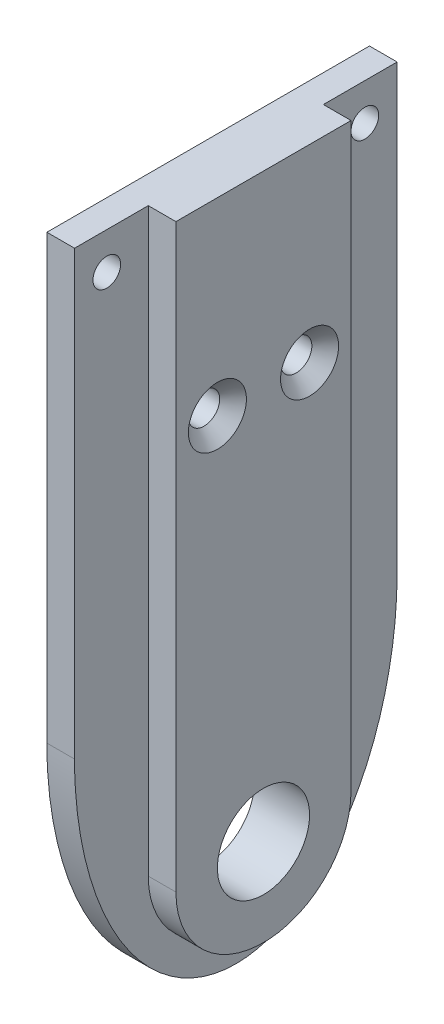
ISO-10303-21;
HEADER;
FILE_DESCRIPTION(('STEP AP214'),'2;1');
FILE_NAME('part.step','',(''),(''),'','','');
FILE_SCHEMA(('AUTOMOTIVE_DESIGN { 1 0 10303 214 1 1 1 1 }'));
ENDSEC;
DATA;
#1=APPLICATION_CONTEXT('core data for automotive mechanical design processes');
#2=APPLICATION_PROTOCOL_DEFINITION('international standard','automotive_design',2000,#1);
#3=PRODUCT_CONTEXT('',#1,'mechanical');
#4=PRODUCT('Part','Part','',(#3));
#5=PRODUCT_RELATED_PRODUCT_CATEGORY('part','',(#4));
#6=PRODUCT_DEFINITION_FORMATION('','',#4);
#7=PRODUCT_DEFINITION_CONTEXT('part definition',#1,'design');
#8=PRODUCT_DEFINITION('design','',#6,#7);
#9=PRODUCT_DEFINITION_SHAPE('','',#8);
#10=(LENGTH_UNIT() NAMED_UNIT(*) SI_UNIT(.MILLI.,.METRE.));
#11=(NAMED_UNIT(*) PLANE_ANGLE_UNIT() SI_UNIT($,.RADIAN.));
#12=(NAMED_UNIT(*) SI_UNIT($,.STERADIAN.) SOLID_ANGLE_UNIT());
#13=UNCERTAINTY_MEASURE_WITH_UNIT(LENGTH_MEASURE(1.E-05),#10,'distance_accuracy_value','');
#14=(GEOMETRIC_REPRESENTATION_CONTEXT(3) GLOBAL_UNCERTAINTY_ASSIGNED_CONTEXT((#13)) GLOBAL_UNIT_ASSIGNED_CONTEXT((#10,
#11,#12)) REPRESENTATION_CONTEXT('',''));
#15=CARTESIAN_POINT('',(0.,0.,0.));
#16=DIRECTION('',(0.,0.,1.));
#17=DIRECTION('',(1.,0.,0.));
#18=AXIS2_PLACEMENT_3D('',#15,#16,#17);
#19=CARTESIAN_POINT('',(6.,0.,-17.5));
#20=DIRECTION('',(0.,0.,1.));
#21=DIRECTION('',(1.,0.,0.));
#22=AXIS2_PLACEMENT_3D('',#19,#20,#21);
#23=PLANE('',#22);
#24=DIRECTION('',(1.,0.,0.));
#25=VECTOR('',#24,1.);
#26=CARTESIAN_POINT('',(-47.762432936357,15.,-17.5));
#27=LINE('',#26,#25);
#28=CARTESIAN_POINT('',(0.,15.,-17.5));
#29=VERTEX_POINT('',#28);
#30=CARTESIAN_POINT('',(3.,15.,-17.5));
#31=VERTEX_POINT('',#30);
#32=EDGE_CURVE('E53',#29,#31,#27,.T.);
#33=ORIENTED_EDGE('',*,*,#32,.F.);
#34=DIRECTION('',(0.,1.,0.));
#35=VECTOR('',#34,1.);
#36=CARTESIAN_POINT('',(0.,0.,-17.5));
#37=LINE('',#36,#35);
#38=CARTESIAN_POINT('',(0.,63.,-17.5));
#39=VERTEX_POINT('',#38);
#40=EDGE_CURVE('E153',#29,#39,#37,.T.);
#41=ORIENTED_EDGE('',*,*,#40,.T.);
#42=DIRECTION('',(-1.,0.,0.));
#43=VECTOR('',#42,1.);
#44=CARTESIAN_POINT('',(6.,63.,-17.5));
#45=LINE('',#44,#43);
#46=CARTESIAN_POINT('',(3.,63.,-17.5));
#47=VERTEX_POINT('',#46);
#48=EDGE_CURVE('E46',#47,#39,#45,.T.);
#49=ORIENTED_EDGE('',*,*,#48,.F.);
#50=DIRECTION('',(0.,1.,0.));
#51=VECTOR('',#50,1.);
#52=CARTESIAN_POINT('',(3.,0.,-17.5));
#53=LINE('',#52,#51);
#54=EDGE_CURVE('E125',#31,#47,#53,.T.);
#55=ORIENTED_EDGE('',*,*,#54,.F.);
#56=EDGE_LOOP('',(#33,#41,#49,#55));
#57=FACE_BOUND('',#56,.T.);
#58=ADVANCED_FACE('F38',(#57),#23,.F.);
#59=CARTESIAN_POINT('',(6.,63.,17.5));
#60=DIRECTION('',(0.,0.,-1.));
#61=DIRECTION('',(0.,1.,0.));
#62=AXIS2_PLACEMENT_3D('',#59,#60,#61);
#63=PLANE('',#62);
#64=DIRECTION('',(0.,-1.,0.));
#65=VECTOR('',#64,1.);
#66=CARTESIAN_POINT('',(0.,63.,17.5));
#67=LINE('',#66,#65);
#68=CARTESIAN_POINT('',(0.,63.,17.5));
#69=VERTEX_POINT('',#68);
#70=CARTESIAN_POINT('',(0.,15.,17.5));
#71=VERTEX_POINT('',#70);
#72=EDGE_CURVE('E117',#69,#71,#67,.T.);
#73=ORIENTED_EDGE('',*,*,#72,.T.);
#74=DIRECTION('',(1.,0.,0.));
#75=VECTOR('',#74,1.);
#76=CARTESIAN_POINT('',(-47.762432936357,15.,17.5));
#77=LINE('',#76,#75);
#78=CARTESIAN_POINT('',(3.,15.,17.5));
#79=VERTEX_POINT('',#78);
#80=EDGE_CURVE('E103',#71,#79,#77,.T.);
#81=ORIENTED_EDGE('',*,*,#80,.T.);
#82=DIRECTION('',(0.,-1.,0.));
#83=VECTOR('',#82,1.);
#84=CARTESIAN_POINT('',(3.,63.,17.5));
#85=LINE('',#84,#83);
#86=CARTESIAN_POINT('',(3.,63.,17.5));
#87=VERTEX_POINT('',#86);
#88=EDGE_CURVE('E114',#87,#79,#85,.T.);
#89=ORIENTED_EDGE('',*,*,#88,.F.);
#90=DIRECTION('',(-1.,0.,0.));
#91=VECTOR('',#90,1.);
#92=CARTESIAN_POINT('',(6.,63.,17.5));
#93=LINE('',#92,#91);
#94=EDGE_CURVE('E11',#87,#69,#93,.T.);
#95=ORIENTED_EDGE('',*,*,#94,.T.);
#96=EDGE_LOOP('',(#73,#81,#89,#95));
#97=FACE_BOUND('',#96,.T.);
#98=ADVANCED_FACE('F113',(#97),#63,.F.);
#99=CARTESIAN_POINT('',(6.,63.,-17.5));
#100=DIRECTION('',(0.,-1.,0.));
#101=DIRECTION('',(0.,0.,-1.));
#102=AXIS2_PLACEMENT_3D('',#99,#100,#101);
#103=PLANE('',#102);
#104=DIRECTION('',(0.,0.,1.));
#105=VECTOR('',#104,1.);
#106=CARTESIAN_POINT('',(6.,63.,-17.5));
#107=LINE('',#106,#105);
#108=CARTESIAN_POINT('',(6.,63.,-9.5));
#109=VERTEX_POINT('',#108);
#110=CARTESIAN_POINT('',(6.,63.,9.49999999999999));
#111=VERTEX_POINT('',#110);
#112=EDGE_CURVE('E150',#109,#111,#107,.T.);
#113=ORIENTED_EDGE('',*,*,#112,.F.);
#114=DIRECTION('',(1.,0.,0.));
#115=VECTOR('',#114,1.);
#116=CARTESIAN_POINT('',(3.,63.,-9.49999999999999));
#117=LINE('',#116,#115);
#118=CARTESIAN_POINT('',(3.,63.,-9.49999999999999));
#119=VERTEX_POINT('',#118);
#120=EDGE_CURVE('E61',#119,#109,#117,.T.);
#121=ORIENTED_EDGE('',*,*,#120,.F.);
#122=DIRECTION('',(0.,0.,1.));
#123=VECTOR('',#122,1.);
#124=CARTESIAN_POINT('',(3.,63.,-17.5));
#125=LINE('',#124,#123);
#126=EDGE_CURVE('E140',#47,#119,#125,.T.);
#127=ORIENTED_EDGE('',*,*,#126,.F.);
#128=ORIENTED_EDGE('',*,*,#48,.T.);
#129=DIRECTION('',(0.,0.,1.));
#130=VECTOR('',#129,1.);
#131=CARTESIAN_POINT('',(0.,63.,-17.5));
#132=LINE('',#131,#130);
#133=EDGE_CURVE('E144',#39,#69,#132,.T.);
#134=ORIENTED_EDGE('',*,*,#133,.T.);
#135=ORIENTED_EDGE('',*,*,#94,.F.);
#136=DIRECTION('',(0.,0.,1.));
#137=VECTOR('',#136,1.);
#138=CARTESIAN_POINT('',(3.,63.,9.49999999999999));
#139=LINE('',#138,#137);
#140=CARTESIAN_POINT('',(3.,63.,9.49999999999999));
#141=VERTEX_POINT('',#140);
#142=EDGE_CURVE('E124',#141,#87,#139,.T.);
#143=ORIENTED_EDGE('',*,*,#142,.F.);
#144=DIRECTION('',(1.,0.,0.));
#145=VECTOR('',#144,1.);
#146=CARTESIAN_POINT('',(3.,63.,9.49999999999999));
#147=LINE('',#146,#145);
#148=EDGE_CURVE('E141',#141,#111,#147,.T.);
#149=ORIENTED_EDGE('',*,*,#148,.T.);
#150=EDGE_LOOP('',(#113,#121,#127,#128,#134,#135,#143,#149));
#151=FACE_BOUND('',#150,.T.);
#152=ADVANCED_FACE('F40',(#151),#103,.F.);
#153=CARTESIAN_POINT('',(6.,0.,0.));
#154=DIRECTION('',(1.,0.,0.));
#155=DIRECTION('',(0.,0.,-1.));
#156=AXIS2_PLACEMENT_3D('',#153,#154,#155);
#157=PLANE('',#156);
#158=CARTESIAN_POINT('',(6.,0.,0.));
#159=DIRECTION('',(1.,0.,0.));
#160=DIRECTION('',(0.,0.,-1.));
#161=AXIS2_PLACEMENT_3D('',#158,#159,#160);
#162=CIRCLE('',#161,5.);
#163=CARTESIAN_POINT('',(6.,0.,-5.));
#164=VERTEX_POINT('',#163);
#165=EDGE_CURVE('E339',#164,#164,#162,.T.);
#166=ORIENTED_EDGE('',*,*,#165,.F.);
#167=EDGE_LOOP('',(#166));
#168=FACE_BOUND('',#167,.T.);
#169=CARTESIAN_POINT('',(6.,42.5,5.));
#170=DIRECTION('',(1.,0.,0.));
#171=DIRECTION('',(0.,0.,-1.));
#172=AXIS2_PLACEMENT_3D('',#169,#170,#171);
#173=CIRCLE('',#172,3.15);
#174=CARTESIAN_POINT('',(6.,42.5,1.85));
#175=VERTEX_POINT('',#174);
#176=EDGE_CURVE('E341',#175,#175,#173,.T.);
#177=ORIENTED_EDGE('',*,*,#176,.F.);
#178=EDGE_LOOP('',(#177));
#179=FACE_BOUND('',#178,.T.);
#180=CARTESIAN_POINT('',(6.,42.5,-5.));
#181=DIRECTION('',(1.,0.,0.));
#182=DIRECTION('',(0.,0.,-1.));
#183=AXIS2_PLACEMENT_3D('',#180,#181,#182);
#184=CIRCLE('',#183,3.15);
#185=CARTESIAN_POINT('',(6.,42.5,-8.15));
#186=VERTEX_POINT('',#185);
#187=EDGE_CURVE('E352',#186,#186,#184,.T.);
#188=ORIENTED_EDGE('',*,*,#187,.F.);
#189=EDGE_LOOP('',(#188));
#190=FACE_BOUND('',#189,.T.);
#191=DIRECTION('',(0.,1.,0.));
#192=VECTOR('',#191,1.);
#193=CARTESIAN_POINT('',(6.,63.,9.49999999999999));
#194=LINE('',#193,#192);
#195=CARTESIAN_POINT('',(6.,0.,9.5));
#196=VERTEX_POINT('',#195);
#197=EDGE_CURVE('E138',#196,#111,#194,.T.);
#198=ORIENTED_EDGE('',*,*,#197,.F.);
#199=CARTESIAN_POINT('',(6.,0.,0.));
#200=DIRECTION('',(-1.,0.,0.));
#201=DIRECTION('',(0.,0.,-1.));
#202=AXIS2_PLACEMENT_3D('',#199,#200,#201);
#203=CIRCLE('',#202,9.5);
#204=CARTESIAN_POINT('',(6.,0.,-9.5));
#205=VERTEX_POINT('',#204);
#206=EDGE_CURVE('E134',#205,#196,#203,.T.);
#207=ORIENTED_EDGE('',*,*,#206,.F.);
#208=DIRECTION('',(0.,-1.,0.));
#209=VECTOR('',#208,1.);
#210=CARTESIAN_POINT('',(6.,0.,-9.5));
#211=LINE('',#210,#209);
#212=EDGE_CURVE('E132',#109,#205,#211,.T.);
#213=ORIENTED_EDGE('',*,*,#212,.F.);
#214=ORIENTED_EDGE('',*,*,#112,.T.);
#215=EDGE_LOOP('',(#198,#207,#213,#214));
#216=FACE_BOUND('',#215,.T.);
#217=ADVANCED_FACE('F204',(#168,#179,#190,#216),#157,.T.);
#218=CARTESIAN_POINT('',(0.,0.,0.));
#219=DIRECTION('',(1.,0.,0.));
#220=DIRECTION('',(0.,0.,-1.));
#221=AXIS2_PLACEMENT_3D('',#218,#219,#220);
#222=PLANE('',#221);
#223=CARTESIAN_POINT('',(0.,0.,0.));
#224=DIRECTION('',(1.,0.,0.));
#225=DIRECTION('',(0.,0.,-1.));
#226=AXIS2_PLACEMENT_3D('',#223,#224,#225);
#227=CIRCLE('',#226,5.);
#228=CARTESIAN_POINT('',(0.,0.,-5.));
#229=VERTEX_POINT('',#228);
#230=EDGE_CURVE('E336',#229,#229,#227,.F.);
#231=ORIENTED_EDGE('',*,*,#230,.F.);
#232=EDGE_LOOP('',(#231));
#233=FACE_BOUND('',#232,.T.);
#234=CARTESIAN_POINT('',(0.,42.5,5.));
#235=DIRECTION('',(1.,0.,0.));
#236=DIRECTION('',(0.,0.,-1.));
#237=AXIS2_PLACEMENT_3D('',#234,#235,#236);
#238=CIRCLE('',#237,1.69999999999999);
#239=CARTESIAN_POINT('',(0.,42.5,3.30000000000001));
#240=VERTEX_POINT('',#239);
#241=EDGE_CURVE('E349',#240,#240,#238,.T.);
#242=ORIENTED_EDGE('',*,*,#241,.T.);
#243=EDGE_LOOP('',(#242));
#244=FACE_BOUND('',#243,.T.);
#245=CARTESIAN_POINT('',(0.,42.5,-5.));
#246=DIRECTION('',(1.,0.,0.));
#247=DIRECTION('',(0.,0.,-1.));
#248=AXIS2_PLACEMENT_3D('',#245,#246,#247);
#249=CIRCLE('',#248,1.69999999999999);
#250=CARTESIAN_POINT('',(0.,42.5,-6.69999999999999));
#251=VERTEX_POINT('',#250);
#252=EDGE_CURVE('E108',#251,#251,#249,.T.);
#253=ORIENTED_EDGE('',*,*,#252,.T.);
#254=EDGE_LOOP('',(#253));
#255=FACE_BOUND('',#254,.T.);
#256=CARTESIAN_POINT('',(0.,59.,-14.));
#257=DIRECTION('',(1.,0.,0.));
#258=DIRECTION('',(0.,0.,-1.));
#259=AXIS2_PLACEMENT_3D('',#256,#257,#258);
#260=CIRCLE('',#259,1.5);
#261=CARTESIAN_POINT('',(0.,59.,-15.5));
#262=VERTEX_POINT('',#261);
#263=EDGE_CURVE('E171',#262,#262,#260,.T.);
#264=ORIENTED_EDGE('',*,*,#263,.T.);
#265=EDGE_LOOP('',(#264));
#266=FACE_BOUND('',#265,.T.);
#267=CARTESIAN_POINT('',(0.,59.,14.));
#268=DIRECTION('',(1.,0.,0.));
#269=DIRECTION('',(0.,0.,-1.));
#270=AXIS2_PLACEMENT_3D('',#267,#268,#269);
#271=CIRCLE('',#270,1.5);
#272=CARTESIAN_POINT('',(0.,59.,12.5));
#273=VERTEX_POINT('',#272);
#274=EDGE_CURVE('E135',#273,#273,#271,.T.);
#275=ORIENTED_EDGE('',*,*,#274,.T.);
#276=EDGE_LOOP('',(#275));
#277=FACE_BOUND('',#276,.T.);
#278=ORIENTED_EDGE('',*,*,#40,.F.);
#279=CARTESIAN_POINT('',(0.,15.,0.));
#280=DIRECTION('',(-1.,0.,0.));
#281=DIRECTION('',(0.,-1.,0.));
#282=AXIS2_PLACEMENT_3D('',#279,#280,#281);
#283=ELLIPSE('',#282,28.,17.5);
#284=EDGE_CURVE('E118',#71,#29,#283,.F.);
#285=ORIENTED_EDGE('',*,*,#284,.F.);
#286=ORIENTED_EDGE('',*,*,#72,.F.);
#287=ORIENTED_EDGE('',*,*,#133,.F.);
#288=EDGE_LOOP('',(#278,#285,#286,#287));
#289=FACE_BOUND('',#288,.T.);
#290=ADVANCED_FACE('F167',(#233,#244,#255,#266,#277,#289),#222,.F.);
#291=CARTESIAN_POINT('',(3.,63.,9.49999999999999));
#292=DIRECTION('',(0.,0.,-1.));
#293=DIRECTION('',(0.,1.,0.));
#294=AXIS2_PLACEMENT_3D('',#291,#292,#293);
#295=PLANE('',#294);
#296=ORIENTED_EDGE('',*,*,#197,.T.);
#297=ORIENTED_EDGE('',*,*,#148,.F.);
#298=DIRECTION('',(0.,1.,0.));
#299=VECTOR('',#298,1.);
#300=CARTESIAN_POINT('',(3.,63.,9.49999999999999));
#301=LINE('',#300,#299);
#302=CARTESIAN_POINT('',(3.,0.,9.5));
#303=VERTEX_POINT('',#302);
#304=EDGE_CURVE('E128',#303,#141,#301,.T.);
#305=ORIENTED_EDGE('',*,*,#304,.F.);
#306=DIRECTION('',(1.,0.,0.));
#307=VECTOR('',#306,1.);
#308=CARTESIAN_POINT('',(3.,0.,9.5));
#309=LINE('',#308,#307);
#310=EDGE_CURVE('E145',#303,#196,#309,.T.);
#311=ORIENTED_EDGE('',*,*,#310,.T.);
#312=EDGE_LOOP('',(#296,#297,#305,#311));
#313=FACE_BOUND('',#312,.T.);
#314=ADVANCED_FACE('F194',(#313),#295,.F.);
#315=CARTESIAN_POINT('',(3.,0.,0.));
#316=DIRECTION('',(1.,0.,0.));
#317=DIRECTION('',(0.,0.,-1.));
#318=AXIS2_PLACEMENT_3D('',#315,#316,#317);
#319=CYLINDRICAL_SURFACE('',#318,9.5);
#320=ORIENTED_EDGE('',*,*,#206,.T.);
#321=ORIENTED_EDGE('',*,*,#310,.F.);
#322=CARTESIAN_POINT('',(3.,0.,0.));
#323=DIRECTION('',(-1.,0.,0.));
#324=DIRECTION('',(0.,0.,-1.));
#325=AXIS2_PLACEMENT_3D('',#322,#323,#324);
#326=CIRCLE('',#325,9.5);
#327=CARTESIAN_POINT('',(3.,0.,-9.5));
#328=VERTEX_POINT('',#327);
#329=EDGE_CURVE('E377',#328,#303,#326,.T.);
#330=ORIENTED_EDGE('',*,*,#329,.F.);
#331=DIRECTION('',(1.,0.,0.));
#332=VECTOR('',#331,1.);
#333=CARTESIAN_POINT('',(3.,0.,-9.5));
#334=LINE('',#333,#332);
#335=EDGE_CURVE('E147',#328,#205,#334,.T.);
#336=ORIENTED_EDGE('',*,*,#335,.T.);
#337=EDGE_LOOP('',(#320,#321,#330,#336));
#338=FACE_BOUND('',#337,.T.);
#339=ADVANCED_FACE('F197',(#338),#319,.T.);
#340=CARTESIAN_POINT('',(3.,0.,-9.5));
#341=DIRECTION('',(0.,0.,1.));
#342=DIRECTION('',(0.,-1.,0.));
#343=AXIS2_PLACEMENT_3D('',#340,#341,#342);
#344=PLANE('',#343);
#345=ORIENTED_EDGE('',*,*,#212,.T.);
#346=ORIENTED_EDGE('',*,*,#335,.F.);
#347=DIRECTION('',(0.,-1.,0.));
#348=VECTOR('',#347,1.);
#349=CARTESIAN_POINT('',(3.,0.,-9.5));
#350=LINE('',#349,#348);
#351=EDGE_CURVE('E374',#119,#328,#350,.T.);
#352=ORIENTED_EDGE('',*,*,#351,.F.);
#353=ORIENTED_EDGE('',*,*,#120,.T.);
#354=EDGE_LOOP('',(#345,#346,#352,#353));
#355=FACE_BOUND('',#354,.T.);
#356=ADVANCED_FACE('F193',(#355),#344,.F.);
#357=CARTESIAN_POINT('',(3.,0.,0.));
#358=DIRECTION('',(1.,0.,0.));
#359=DIRECTION('',(0.,0.,-1.));
#360=AXIS2_PLACEMENT_3D('',#357,#358,#359);
#361=PLANE('',#360);
#362=CARTESIAN_POINT('',(3.,15.,0.));
#363=DIRECTION('',(-1.,0.,0.));
#364=DIRECTION('',(0.,-1.,0.));
#365=AXIS2_PLACEMENT_3D('',#362,#363,#364);
#366=ELLIPSE('',#365,28.,17.5);
#367=EDGE_CURVE('E100',#31,#79,#366,.T.);
#368=ORIENTED_EDGE('',*,*,#367,.F.);
#369=ORIENTED_EDGE('',*,*,#54,.T.);
#370=ORIENTED_EDGE('',*,*,#126,.T.);
#371=ORIENTED_EDGE('',*,*,#351,.T.);
#372=ORIENTED_EDGE('',*,*,#329,.T.);
#373=ORIENTED_EDGE('',*,*,#304,.T.);
#374=ORIENTED_EDGE('',*,*,#142,.T.);
#375=ORIENTED_EDGE('',*,*,#88,.T.);
#376=EDGE_LOOP('',(#368,#369,#370,#371,#372,#373,#374,#375));
#377=FACE_BOUND('',#376,.T.);
#378=CARTESIAN_POINT('',(3.,59.,-14.));
#379=DIRECTION('',(1.,0.,0.));
#380=DIRECTION('',(0.,0.,-1.));
#381=AXIS2_PLACEMENT_3D('',#378,#379,#380);
#382=CIRCLE('',#381,1.5);
#383=CARTESIAN_POINT('',(3.,59.,-15.5));
#384=VERTEX_POINT('',#383);
#385=EDGE_CURVE('E168',#384,#384,#382,.T.);
#386=ORIENTED_EDGE('',*,*,#385,.F.);
#387=EDGE_LOOP('',(#386));
#388=FACE_BOUND('',#387,.T.);
#389=CARTESIAN_POINT('',(3.,59.,14.));
#390=DIRECTION('',(1.,0.,0.));
#391=DIRECTION('',(0.,0.,-1.));
#392=AXIS2_PLACEMENT_3D('',#389,#390,#391);
#393=CIRCLE('',#392,1.5);
#394=CARTESIAN_POINT('',(3.,59.,12.5));
#395=VERTEX_POINT('',#394);
#396=EDGE_CURVE('E367',#395,#395,#393,.T.);
#397=ORIENTED_EDGE('',*,*,#396,.F.);
#398=EDGE_LOOP('',(#397));
#399=FACE_BOUND('',#398,.T.);
#400=ADVANCED_FACE('F120',(#377,#388,#399),#361,.T.);
#401=CARTESIAN_POINT('',(3.,59.,14.));
#402=DIRECTION('',(1.,0.,0.));
#403=DIRECTION('',(0.,0.,-1.));
#404=AXIS2_PLACEMENT_3D('',#401,#402,#403);
#405=CYLINDRICAL_SURFACE('',#404,1.5);
#406=ORIENTED_EDGE('',*,*,#274,.F.);
#407=EDGE_LOOP('',(#406));
#408=FACE_BOUND('',#407,.T.);
#409=ORIENTED_EDGE('',*,*,#396,.T.);
#410=EDGE_LOOP('',(#409));
#411=FACE_BOUND('',#410,.T.);
#412=ADVANCED_FACE('F186',(#408,#411),#405,.F.);
#413=CARTESIAN_POINT('',(3.,59.,-14.));
#414=DIRECTION('',(1.,0.,0.));
#415=DIRECTION('',(0.,0.,-1.));
#416=AXIS2_PLACEMENT_3D('',#413,#414,#415);
#417=CYLINDRICAL_SURFACE('',#416,1.5);
#418=ORIENTED_EDGE('',*,*,#263,.F.);
#419=EDGE_LOOP('',(#418));
#420=FACE_BOUND('',#419,.T.);
#421=ORIENTED_EDGE('',*,*,#385,.T.);
#422=EDGE_LOOP('',(#421));
#423=FACE_BOUND('',#422,.T.);
#424=ADVANCED_FACE('F182',(#420,#423),#417,.F.);
#425=CARTESIAN_POINT('',(-47.762432936357,15.,0.));
#426=DIRECTION('',(-1.,0.,0.));
#427=DIRECTION('',(0.,-1.,0.));
#428=AXIS2_PLACEMENT_3D('',#425,#426,#427);
#429=ELLIPSE('',#428,28.,17.5);
#430=DIRECTION('',(1.,0.,0.));
#431=VECTOR('',#430,1.);
#432=SURFACE_OF_LINEAR_EXTRUSION('',#429,#431);
#433=ORIENTED_EDGE('',*,*,#284,.T.);
#434=ORIENTED_EDGE('',*,*,#32,.T.);
#435=ORIENTED_EDGE('',*,*,#367,.T.);
#436=ORIENTED_EDGE('',*,*,#80,.F.);
#437=EDGE_LOOP('',(#433,#434,#435,#436));
#438=FACE_BOUND('',#437,.T.);
#439=ADVANCED_FACE('F102',(#438),#432,.F.);
#440=CARTESIAN_POINT('',(6.,42.5,-5.));
#441=DIRECTION('',(1.,0.,0.));
#442=DIRECTION('',(0.,0.,-1.));
#443=AXIS2_PLACEMENT_3D('',#440,#441,#442);
#444=CYLINDRICAL_SURFACE('',#443,1.69999999999999);
#445=ORIENTED_EDGE('',*,*,#252,.F.);
#446=EDGE_LOOP('',(#445));
#447=FACE_BOUND('',#446,.T.);
#448=CARTESIAN_POINT('',(4.55,42.5,-5.));
#449=DIRECTION('',(1.,0.,0.));
#450=DIRECTION('',(0.,0.,-1.));
#451=AXIS2_PLACEMENT_3D('',#448,#449,#450);
#452=CIRCLE('',#451,1.7);
#453=CARTESIAN_POINT('',(4.55,42.5,-6.7));
#454=VERTEX_POINT('',#453);
#455=EDGE_CURVE('E354',#454,#454,#452,.T.);
#456=ORIENTED_EDGE('',*,*,#455,.T.);
#457=EDGE_LOOP('',(#456));
#458=FACE_BOUND('',#457,.T.);
#459=ADVANCED_FACE('F181',(#447,#458),#444,.F.);
#460=CARTESIAN_POINT('',(6.,42.5,-5.));
#461=DIRECTION('',(1.,0.,0.));
#462=DIRECTION('',(0.,0.,-1.));
#463=AXIS2_PLACEMENT_3D('',#460,#461,#462);
#464=CONICAL_SURFACE('',#463,3.15,0.785398163397447);
#465=ORIENTED_EDGE('',*,*,#455,.F.);
#466=EDGE_LOOP('',(#465));
#467=FACE_BOUND('',#466,.T.);
#468=ORIENTED_EDGE('',*,*,#187,.T.);
#469=EDGE_LOOP('',(#468));
#470=FACE_BOUND('',#469,.T.);
#471=ADVANCED_FACE('F263',(#467,#470),#464,.F.);
#472=CARTESIAN_POINT('',(6.,42.5,5.));
#473=DIRECTION('',(1.,0.,0.));
#474=DIRECTION('',(0.,0.,-1.));
#475=AXIS2_PLACEMENT_3D('',#472,#473,#474);
#476=CYLINDRICAL_SURFACE('',#475,1.69999999999999);
#477=ORIENTED_EDGE('',*,*,#241,.F.);
#478=EDGE_LOOP('',(#477));
#479=FACE_BOUND('',#478,.T.);
#480=CARTESIAN_POINT('',(4.55,42.5,5.));
#481=DIRECTION('',(1.,0.,0.));
#482=DIRECTION('',(0.,0.,-1.));
#483=AXIS2_PLACEMENT_3D('',#480,#481,#482);
#484=CIRCLE('',#483,1.7);
#485=CARTESIAN_POINT('',(4.55,42.5,3.3));
#486=VERTEX_POINT('',#485);
#487=EDGE_CURVE('E346',#486,#486,#484,.T.);
#488=ORIENTED_EDGE('',*,*,#487,.T.);
#489=EDGE_LOOP('',(#488));
#490=FACE_BOUND('',#489,.T.);
#491=ADVANCED_FACE('F270',(#479,#490),#476,.F.);
#492=CARTESIAN_POINT('',(6.,42.5,5.));
#493=DIRECTION('',(1.,0.,0.));
#494=DIRECTION('',(0.,0.,-1.));
#495=AXIS2_PLACEMENT_3D('',#492,#493,#494);
#496=CONICAL_SURFACE('',#495,3.15,0.785398163397447);
#497=ORIENTED_EDGE('',*,*,#487,.F.);
#498=EDGE_LOOP('',(#497));
#499=FACE_BOUND('',#498,.T.);
#500=ORIENTED_EDGE('',*,*,#176,.T.);
#501=EDGE_LOOP('',(#500));
#502=FACE_BOUND('',#501,.T.);
#503=ADVANCED_FACE('F277',(#499,#502),#496,.F.);
#504=CARTESIAN_POINT('',(-14.142135623731,0.,0.));
#505=DIRECTION('',(1.,0.,0.));
#506=DIRECTION('',(0.,0.,-1.));
#507=AXIS2_PLACEMENT_3D('',#504,#505,#506);
#508=CYLINDRICAL_SURFACE('',#507,5.);
#509=ORIENTED_EDGE('',*,*,#230,.T.);
#510=EDGE_LOOP('',(#509));
#511=FACE_BOUND('',#510,.T.);
#512=ORIENTED_EDGE('',*,*,#165,.T.);
#513=EDGE_LOOP('',(#512));
#514=FACE_BOUND('',#513,.T.);
#515=ADVANCED_FACE('F284',(#511,#514),#508,.F.);
#516=CLOSED_SHELL('',(#58,#98,#152,#217,#290,#314,#339,#356,#400,#412,#424,#439,#459,#471,#491,
#503,#515));
#517=MANIFOLD_SOLID_BREP('B2',#516);
#518=ADVANCED_BREP_SHAPE_REPRESENTATION('',(#18,#517),#14);
#519=SHAPE_DEFINITION_REPRESENTATION(#9,#518);
ENDSEC;
END-ISO-10303-21;
